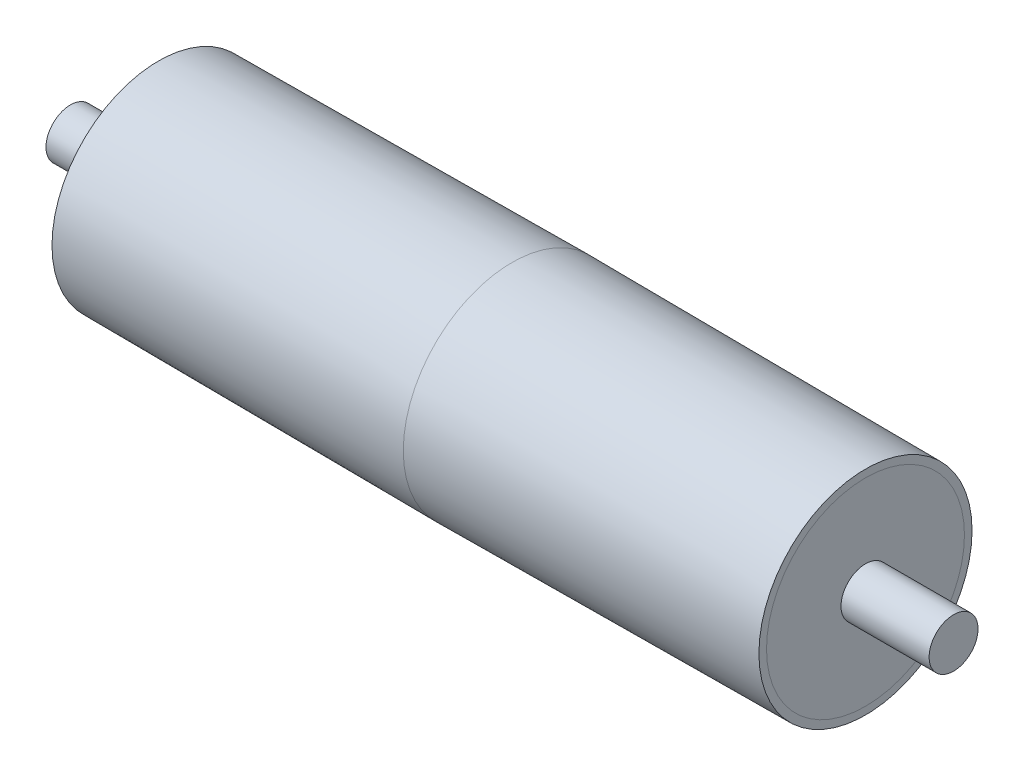
ISO-10303-21;
HEADER;
FILE_DESCRIPTION(('STEP AP214'),'2;1');
FILE_NAME('part.step','',(''),(''),'','','');
FILE_SCHEMA(('AUTOMOTIVE_DESIGN { 1 0 10303 214 1 1 1 1 }'));
ENDSEC;
DATA;
#1=APPLICATION_CONTEXT('core data for automotive mechanical design processes');
#2=APPLICATION_PROTOCOL_DEFINITION('international standard','automotive_design',2000,#1);
#3=PRODUCT_CONTEXT('',#1,'mechanical');
#4=PRODUCT('Part','Part','',(#3));
#5=PRODUCT_RELATED_PRODUCT_CATEGORY('part','',(#4));
#6=PRODUCT_DEFINITION_FORMATION('','',#4);
#7=PRODUCT_DEFINITION_CONTEXT('part definition',#1,'design');
#8=PRODUCT_DEFINITION('design','',#6,#7);
#9=PRODUCT_DEFINITION_SHAPE('','',#8);
#10=(LENGTH_UNIT() NAMED_UNIT(*) SI_UNIT(.MILLI.,.METRE.));
#11=(NAMED_UNIT(*) PLANE_ANGLE_UNIT() SI_UNIT($,.RADIAN.));
#12=(NAMED_UNIT(*) SI_UNIT($,.STERADIAN.) SOLID_ANGLE_UNIT());
#13=UNCERTAINTY_MEASURE_WITH_UNIT(LENGTH_MEASURE(1.E-05),#10,'distance_accuracy_value','');
#14=(GEOMETRIC_REPRESENTATION_CONTEXT(3) GLOBAL_UNCERTAINTY_ASSIGNED_CONTEXT((#13)) GLOBAL_UNIT_ASSIGNED_CONTEXT((#10,
#11,#12)) REPRESENTATION_CONTEXT('',''));
#15=CARTESIAN_POINT('',(0.,0.,0.));
#16=DIRECTION('',(0.,0.,1.));
#17=DIRECTION('',(1.,0.,0.));
#18=AXIS2_PLACEMENT_3D('',#15,#16,#17);
#19=CARTESIAN_POINT('',(406.,0.,0.));
#20=DIRECTION('',(-1.,0.,0.));
#21=DIRECTION('',(0.,0.,1.));
#22=AXIS2_PLACEMENT_3D('',#19,#20,#21);
#23=CYLINDRICAL_SURFACE('',#22,22.5);
#24=CARTESIAN_POINT('',(406.,0.,0.));
#25=DIRECTION('',(1.,0.,0.));
#26=DIRECTION('',(0.,0.,-1.));
#27=AXIS2_PLACEMENT_3D('',#24,#25,#26);
#28=CIRCLE('',#27,22.5);
#29=CARTESIAN_POINT('',(406.,0.,22.5));
#30=VERTEX_POINT('',#29);
#31=EDGE_CURVE('E11',#30,#30,#28,.T.);
#32=CARTESIAN_POINT('',(-406.,0.,0.));
#33=DIRECTION('',(1.,0.,0.));
#34=DIRECTION('',(0.,0.,-1.));
#35=AXIS2_PLACEMENT_3D('',#32,#33,#34);
#36=CIRCLE('',#35,22.5);
#37=CARTESIAN_POINT('',(-406.,0.,22.5));
#38=VERTEX_POINT('',#37);
#39=EDGE_CURVE('E45',#38,#38,#36,.T.);
#40=CARTESIAN_POINT('',(406.,0.,22.5));
#41=CARTESIAN_POINT('',(397.541666666667,0.,22.5));
#42=CARTESIAN_POINT('',(389.083333333333,0.,22.5));
#43=CARTESIAN_POINT('',(372.166666666667,0.,22.5));
#44=CARTESIAN_POINT('',(363.708333333333,0.,22.5));
#45=CARTESIAN_POINT('',(346.791666666667,0.,22.5));
#46=CARTESIAN_POINT('',(338.333333333333,0.,22.5));
#47=CARTESIAN_POINT('',(321.416666666667,0.,22.5));
#48=CARTESIAN_POINT('',(312.958333333333,0.,22.5));
#49=CARTESIAN_POINT('',(296.041666666667,0.,22.5));
#50=CARTESIAN_POINT('',(287.583333333333,0.,22.5));
#51=CARTESIAN_POINT('',(270.666666666667,0.,22.5));
#52=CARTESIAN_POINT('',(262.208333333333,0.,22.5));
#53=CARTESIAN_POINT('',(245.291666666667,0.,22.5));
#54=CARTESIAN_POINT('',(236.833333333333,0.,22.5));
#55=CARTESIAN_POINT('',(219.916666666667,0.,22.5));
#56=CARTESIAN_POINT('',(211.458333333333,0.,22.5));
#57=CARTESIAN_POINT('',(194.541666666667,0.,22.5));
#58=CARTESIAN_POINT('',(186.083333333333,0.,22.5));
#59=CARTESIAN_POINT('',(169.166666666667,0.,22.5));
#60=CARTESIAN_POINT('',(160.708333333333,0.,22.5));
#61=CARTESIAN_POINT('',(143.791666666667,0.,22.5));
#62=CARTESIAN_POINT('',(135.333333333333,0.,22.5));
#63=CARTESIAN_POINT('',(118.416666666667,0.,22.5));
#64=CARTESIAN_POINT('',(109.958333333333,0.,22.5));
#65=CARTESIAN_POINT('',(93.0416666666666,0.,22.5));
#66=CARTESIAN_POINT('',(84.5833333333333,0.,22.5));
#67=CARTESIAN_POINT('',(67.6666666666666,0.,22.5));
#68=CARTESIAN_POINT('',(59.2083333333333,0.,22.5));
#69=CARTESIAN_POINT('',(42.2916666666666,0.,22.5));
#70=CARTESIAN_POINT('',(33.8333333333333,0.,22.5));
#71=CARTESIAN_POINT('',(16.9166666666666,0.,22.5));
#72=CARTESIAN_POINT('',(8.45833333333329,0.,22.5));
#73=CARTESIAN_POINT('',(-8.4583333333334,0.,22.5));
#74=CARTESIAN_POINT('',(-16.9166666666667,0.,22.5));
#75=CARTESIAN_POINT('',(-33.8333333333334,0.,22.5));
#76=CARTESIAN_POINT('',(-42.2916666666667,0.,22.5));
#77=CARTESIAN_POINT('',(-59.2083333333334,0.,22.5));
#78=CARTESIAN_POINT('',(-67.6666666666667,0.,22.5));
#79=CARTESIAN_POINT('',(-84.5833333333334,0.,22.5));
#80=CARTESIAN_POINT('',(-93.0416666666667,0.,22.5));
#81=CARTESIAN_POINT('',(-109.958333333333,0.,22.5));
#82=CARTESIAN_POINT('',(-118.416666666667,0.,22.5));
#83=CARTESIAN_POINT('',(-135.333333333333,0.,22.5));
#84=CARTESIAN_POINT('',(-143.791666666667,0.,22.5));
#85=CARTESIAN_POINT('',(-160.708333333333,0.,22.5));
#86=CARTESIAN_POINT('',(-169.166666666667,0.,22.5));
#87=CARTESIAN_POINT('',(-186.083333333333,0.,22.5));
#88=CARTESIAN_POINT('',(-194.541666666667,0.,22.5));
#89=CARTESIAN_POINT('',(-211.458333333333,0.,22.5));
#90=CARTESIAN_POINT('',(-219.916666666667,0.,22.5));
#91=CARTESIAN_POINT('',(-236.833333333333,0.,22.5));
#92=CARTESIAN_POINT('',(-245.291666666667,0.,22.5));
#93=CARTESIAN_POINT('',(-262.208333333333,0.,22.5));
#94=CARTESIAN_POINT('',(-270.666666666667,0.,22.5));
#95=CARTESIAN_POINT('',(-287.583333333333,0.,22.5));
#96=CARTESIAN_POINT('',(-296.041666666667,0.,22.5));
#97=CARTESIAN_POINT('',(-312.958333333333,0.,22.5));
#98=CARTESIAN_POINT('',(-321.416666666667,0.,22.5));
#99=CARTESIAN_POINT('',(-338.333333333333,0.,22.5));
#100=CARTESIAN_POINT('',(-346.791666666667,0.,22.5));
#101=CARTESIAN_POINT('',(-363.708333333333,0.,22.5));
#102=CARTESIAN_POINT('',(-372.166666666667,0.,22.5));
#103=CARTESIAN_POINT('',(-389.083333333333,0.,22.5));
#104=CARTESIAN_POINT('',(-397.541666666667,0.,22.5));
#105=CARTESIAN_POINT('',(-406.,0.,22.5));
#106=B_SPLINE_CURVE_WITH_KNOTS('',3,(#40,#41,#42,#43,#44,#45,#46,#47,#48,#49,#50,#51,#52,#53,
#54,#55,#56,#57,#58,#59,#60,#61,#62,#63,#64,#65,#66,#67,#68,#69,#70,#71,#72,#73,#74,#75,#76,#77,
#78,#79,#80,#81,#82,#83,#84,#85,#86,#87,#88,#89,#90,#91,#92,#93,#94,#95,#96,#97,#98,#99,#100,
#101,#102,#103,#104,#105),.UNSPECIFIED.,.F.,.F.,(4,2,2,2,2,2,2,2,2,2,2,2,2,2,2,2,2,2,2,2,2,2,2,
2,2,2,2,2,2,2,2,2,4),(0.,25.375,50.75,76.1250000000001,101.5,126.875,152.25,177.625,203.,
228.375,253.75,279.125,304.5,329.875,355.25,380.625,406.,431.375,456.75,482.125,507.5,532.875,
558.25,583.625,609.,634.375,659.75,685.125,710.5,735.875,761.25,786.625,812.),.UNSPECIFIED.);
#107=EDGE_CURVE('BSEAM42',#30,#38,#106,.T.);
#108=ORIENTED_EDGE('',*,*,#31,.F.);
#109=ORIENTED_EDGE('',*,*,#39,.T.);
#110=ORIENTED_EDGE('',*,*,#107,.T.);
#111=ORIENTED_EDGE('',*,*,#107,.F.);
#112=EDGE_LOOP('',(#108,#110,#109,#111));
#113=FACE_BOUND('',#112,.T.);
#114=ADVANCED_FACE('F42',(#113),#23,.T.);
#115=CARTESIAN_POINT('',(406.,0.,0.));
#116=DIRECTION('',(1.,0.,0.));
#117=DIRECTION('',(0.,0.,-1.));
#118=AXIS2_PLACEMENT_3D('',#115,#116,#117);
#119=PLANE('',#118);
#120=ORIENTED_EDGE('',*,*,#31,.T.);
#121=EDGE_LOOP('',(#120));
#122=FACE_BOUND('',#121,.T.);
#123=ADVANCED_FACE('F57',(#122),#119,.T.);
#124=CARTESIAN_POINT('',(-406.,0.,0.));
#125=DIRECTION('',(1.,0.,0.));
#126=DIRECTION('',(0.,0.,-1.));
#127=AXIS2_PLACEMENT_3D('',#124,#125,#126);
#128=PLANE('',#127);
#129=ORIENTED_EDGE('',*,*,#39,.F.);
#130=EDGE_LOOP('',(#129));
#131=FACE_BOUND('',#130,.T.);
#132=ADVANCED_FACE('F55',(#131),#128,.F.);
#133=CLOSED_SHELL('',(#114,#123,#132));
#134=MANIFOLD_SOLID_BREP('B2',#133);
#135=CARTESIAN_POINT('',(-315.,0.,0.));
#136=DIRECTION('',(-1.,0.,0.));
#137=DIRECTION('',(0.,0.,-1.));
#138=AXIS2_PLACEMENT_3D('',#135,#136,#137);
#139=CYLINDRICAL_SURFACE('',#138,90.9998674568761);
#140=CARTESIAN_POINT('',(-315.,0.,0.));
#141=DIRECTION('',(1.,0.,0.));
#142=DIRECTION('',(0.,0.,-1.));
#143=AXIS2_PLACEMENT_3D('',#140,#141,#142);
#144=CIRCLE('',#143,90.9998674568761);
#145=CARTESIAN_POINT('',(-315.,0.,-90.9998674568761));
#146=VERTEX_POINT('',#145);
#147=EDGE_CURVE('E41',#146,#146,#144,.T.);
#148=ORIENTED_EDGE('',*,*,#147,.F.);
#149=EDGE_LOOP('',(#148));
#150=FACE_BOUND('',#149,.T.);
#151=CARTESIAN_POINT('',(-325.,0.,0.));
#152=DIRECTION('',(1.,0.,0.));
#153=DIRECTION('',(0.,0.,-1.));
#154=AXIS2_PLACEMENT_3D('',#151,#152,#153);
#155=CIRCLE('',#154,90.9998674568761);
#156=CARTESIAN_POINT('',(-325.,0.,-90.9998674568761));
#157=VERTEX_POINT('',#156);
#158=EDGE_CURVE('E98',#157,#157,#155,.T.);
#159=ORIENTED_EDGE('',*,*,#158,.T.);
#160=EDGE_LOOP('',(#159));
#161=FACE_BOUND('',#160,.T.);
#162=ADVANCED_FACE('F91',(#150,#161),#139,.T.);
#163=CARTESIAN_POINT('',(-315.,0.,0.));
#164=DIRECTION('',(-1.,0.,0.));
#165=DIRECTION('',(0.,0.,-1.));
#166=AXIS2_PLACEMENT_3D('',#163,#164,#165);
#167=PLANE('',#166);
#168=CARTESIAN_POINT('',(-315.,0.,0.));
#169=DIRECTION('',(-1.,0.,0.));
#170=DIRECTION('',(0.,0.,1.));
#171=AXIS2_PLACEMENT_3D('',#168,#169,#170);
#172=CIRCLE('',#171,22.5);
#173=CARTESIAN_POINT('',(-315.,0.,22.5));
#174=VERTEX_POINT('',#173);
#175=EDGE_CURVE('E103',#174,#174,#172,.T.);
#176=ORIENTED_EDGE('',*,*,#175,.T.);
#177=EDGE_LOOP('',(#176));
#178=FACE_BOUND('',#177,.T.);
#179=ORIENTED_EDGE('',*,*,#147,.T.);
#180=EDGE_LOOP('',(#179));
#181=FACE_BOUND('',#180,.T.);
#182=ADVANCED_FACE('F117',(#178,#181),#167,.F.);
#183=CARTESIAN_POINT('',(-325.,0.,0.));
#184=DIRECTION('',(-1.,0.,0.));
#185=DIRECTION('',(0.,0.,-1.));
#186=AXIS2_PLACEMENT_3D('',#183,#184,#185);
#187=PLANE('',#186);
#188=CARTESIAN_POINT('',(-325.,0.,0.));
#189=DIRECTION('',(-1.,0.,0.));
#190=DIRECTION('',(0.,0.,1.));
#191=AXIS2_PLACEMENT_3D('',#188,#189,#190);
#192=CIRCLE('',#191,22.5);
#193=CARTESIAN_POINT('',(-325.,0.,22.5));
#194=VERTEX_POINT('',#193);
#195=EDGE_CURVE('E94',#194,#194,#192,.T.);
#196=ORIENTED_EDGE('',*,*,#195,.F.);
#197=EDGE_LOOP('',(#196));
#198=FACE_BOUND('',#197,.T.);
#199=ORIENTED_EDGE('',*,*,#158,.F.);
#200=EDGE_LOOP('',(#199));
#201=FACE_BOUND('',#200,.T.);
#202=ADVANCED_FACE('F114',(#198,#201),#187,.T.);
#203=CARTESIAN_POINT('',(-410.,0.,0.));
#204=DIRECTION('',(1.,0.,0.));
#205=DIRECTION('',(0.,0.,-1.));
#206=AXIS2_PLACEMENT_3D('',#203,#204,#205);
#207=CYLINDRICAL_SURFACE('',#206,22.5);
#208=ORIENTED_EDGE('',*,*,#195,.T.);
#209=EDGE_LOOP('',(#208));
#210=FACE_BOUND('',#209,.T.);
#211=ORIENTED_EDGE('',*,*,#175,.F.);
#212=EDGE_LOOP('',(#211));
#213=FACE_BOUND('',#212,.T.);
#214=ADVANCED_FACE('F111',(#210,#213),#207,.F.);
#215=CLOSED_SHELL('',(#162,#182,#202,#214));
#216=MANIFOLD_SOLID_BREP('B6',#215);
#217=CARTESIAN_POINT('',(315.,0.,0.));
#218=DIRECTION('',(1.,0.,0.));
#219=DIRECTION('',(0.,0.,-1.));
#220=AXIS2_PLACEMENT_3D('',#217,#218,#219);
#221=CYLINDRICAL_SURFACE('',#220,90.9998674568761);
#222=CARTESIAN_POINT('',(315.,0.,0.));
#223=DIRECTION('',(1.,0.,0.));
#224=DIRECTION('',(0.,0.,-1.));
#225=AXIS2_PLACEMENT_3D('',#222,#223,#224);
#226=CIRCLE('',#225,90.9998674568761);
#227=CARTESIAN_POINT('',(315.,0.,-90.9998674568761));
#228=VERTEX_POINT('',#227);
#229=EDGE_CURVE('E90',#228,#228,#226,.T.);
#230=ORIENTED_EDGE('',*,*,#229,.T.);
#231=EDGE_LOOP('',(#230));
#232=FACE_BOUND('',#231,.T.);
#233=CARTESIAN_POINT('',(325.,0.,0.));
#234=DIRECTION('',(1.,0.,0.));
#235=DIRECTION('',(0.,0.,-1.));
#236=AXIS2_PLACEMENT_3D('',#233,#234,#235);
#237=CIRCLE('',#236,90.9998674568761);
#238=CARTESIAN_POINT('',(325.,0.,-90.9998674568761));
#239=VERTEX_POINT('',#238);
#240=EDGE_CURVE('E163',#239,#239,#237,.T.);
#241=ORIENTED_EDGE('',*,*,#240,.F.);
#242=EDGE_LOOP('',(#241));
#243=FACE_BOUND('',#242,.T.);
#244=ADVANCED_FACE('F160',(#232,#243),#221,.T.);
#245=CARTESIAN_POINT('',(315.,0.,0.));
#246=DIRECTION('',(1.,0.,0.));
#247=DIRECTION('',(0.,0.,-1.));
#248=AXIS2_PLACEMENT_3D('',#245,#246,#247);
#249=PLANE('',#248);
#250=CARTESIAN_POINT('',(315.,0.,0.));
#251=DIRECTION('',(1.,0.,0.));
#252=DIRECTION('',(0.,0.,-1.));
#253=AXIS2_PLACEMENT_3D('',#250,#251,#252);
#254=CIRCLE('',#253,22.5);
#255=CARTESIAN_POINT('',(315.,0.,-22.5));
#256=VERTEX_POINT('',#255);
#257=EDGE_CURVE('E170',#256,#256,#254,.T.);
#258=ORIENTED_EDGE('',*,*,#257,.T.);
#259=EDGE_LOOP('',(#258));
#260=FACE_BOUND('',#259,.T.);
#261=ORIENTED_EDGE('',*,*,#229,.F.);
#262=EDGE_LOOP('',(#261));
#263=FACE_BOUND('',#262,.T.);
#264=ADVANCED_FACE('F184',(#260,#263),#249,.F.);
#265=CARTESIAN_POINT('',(325.,0.,0.));
#266=DIRECTION('',(1.,0.,0.));
#267=DIRECTION('',(0.,0.,-1.));
#268=AXIS2_PLACEMENT_3D('',#265,#266,#267);
#269=PLANE('',#268);
#270=CARTESIAN_POINT('',(325.,0.,0.));
#271=DIRECTION('',(1.,0.,0.));
#272=DIRECTION('',(0.,0.,-1.));
#273=AXIS2_PLACEMENT_3D('',#270,#271,#272);
#274=CIRCLE('',#273,22.5);
#275=CARTESIAN_POINT('',(325.,0.,-22.5));
#276=VERTEX_POINT('',#275);
#277=EDGE_CURVE('E174',#276,#276,#274,.T.);
#278=ORIENTED_EDGE('',*,*,#277,.F.);
#279=EDGE_LOOP('',(#278));
#280=FACE_BOUND('',#279,.T.);
#281=ORIENTED_EDGE('',*,*,#240,.T.);
#282=EDGE_LOOP('',(#281));
#283=FACE_BOUND('',#282,.T.);
#284=ADVANCED_FACE('F181',(#280,#283),#269,.T.);
#285=CARTESIAN_POINT('',(-410.,0.,0.));
#286=DIRECTION('',(1.,0.,0.));
#287=DIRECTION('',(0.,0.,-1.));
#288=AXIS2_PLACEMENT_3D('',#285,#286,#287);
#289=CYLINDRICAL_SURFACE('',#288,22.5);
#290=ORIENTED_EDGE('',*,*,#277,.T.);
#291=EDGE_LOOP('',(#290));
#292=FACE_BOUND('',#291,.T.);
#293=ORIENTED_EDGE('',*,*,#257,.F.);
#294=EDGE_LOOP('',(#293));
#295=FACE_BOUND('',#294,.T.);
#296=ADVANCED_FACE('F178',(#292,#295),#289,.F.);
#297=CLOSED_SHELL('',(#244,#264,#284,#296));
#298=MANIFOLD_SOLID_BREP('B36',#297);
#299=CARTESIAN_POINT('',(-325.,98.,0.));
#300=DIRECTION('',(1.,0.,0.));
#301=DIRECTION('',(0.,0.,-1.));
#302=AXIS2_PLACEMENT_3D('',#299,#300,#301);
#303=PLANE('',#302);
#304=CARTESIAN_POINT('',(-325.,0.,0.));
#305=DIRECTION('',(1.,0.,0.));
#306=DIRECTION('',(0.,0.,-1.));
#307=AXIS2_PLACEMENT_3D('',#304,#305,#306);
#308=CIRCLE('',#307,90.9998674568761);
#309=CARTESIAN_POINT('',(-325.,0.,-90.9998674568761));
#310=VERTEX_POINT('',#309);
#311=EDGE_CURVE('E239',#310,#310,#308,.F.);
#312=ORIENTED_EDGE('',*,*,#311,.F.);
#313=EDGE_LOOP('',(#312));
#314=FACE_BOUND('',#313,.T.);
#315=CARTESIAN_POINT('',(-325.,0.,0.));
#316=DIRECTION('',(-1.,0.,0.));
#317=DIRECTION('',(0.,0.,1.));
#318=AXIS2_PLACEMENT_3D('',#315,#316,#317);
#319=CIRCLE('',#318,98.);
#320=CARTESIAN_POINT('',(-325.,0.,98.));
#321=VERTEX_POINT('',#320);
#322=EDGE_CURVE('E232',#321,#321,#319,.T.);
#323=ORIENTED_EDGE('',*,*,#322,.T.);
#324=EDGE_LOOP('',(#323));
#325=FACE_BOUND('',#324,.T.);
#326=ADVANCED_FACE('F222',(#314,#325),#303,.F.);
#327=CARTESIAN_POINT('',(325.,0.,0.));
#328=DIRECTION('',(-1.,0.,0.));
#329=DIRECTION('',(0.,0.,1.));
#330=AXIS2_PLACEMENT_3D('',#327,#328,#329);
#331=PLANE('',#330);
#332=CARTESIAN_POINT('',(325.,0.,0.));
#333=DIRECTION('',(-1.,0.,0.));
#334=DIRECTION('',(0.,0.,1.));
#335=AXIS2_PLACEMENT_3D('',#332,#333,#334);
#336=CIRCLE('',#335,90.9998674568761);
#337=CARTESIAN_POINT('',(325.,0.,90.9998674568761));
#338=VERTEX_POINT('',#337);
#339=EDGE_CURVE('E236',#338,#338,#336,.T.);
#340=ORIENTED_EDGE('',*,*,#339,.T.);
#341=EDGE_LOOP('',(#340));
#342=FACE_BOUND('',#341,.T.);
#343=CARTESIAN_POINT('',(325.,0.,0.));
#344=DIRECTION('',(-1.,0.,0.));
#345=DIRECTION('',(0.,0.,1.));
#346=AXIS2_PLACEMENT_3D('',#343,#344,#345);
#347=CIRCLE('',#346,98.);
#348=CARTESIAN_POINT('',(325.,0.,98.));
#349=VERTEX_POINT('',#348);
#350=EDGE_CURVE('E159',#349,#349,#347,.T.);
#351=ORIENTED_EDGE('',*,*,#350,.F.);
#352=EDGE_LOOP('',(#351));
#353=FACE_BOUND('',#352,.T.);
#354=ADVANCED_FACE('F262',(#342,#353),#331,.F.);
#355=CARTESIAN_POINT('',(325.,0.,0.));
#356=DIRECTION('',(-1.,0.,0.));
#357=DIRECTION('',(0.,0.,1.));
#358=AXIS2_PLACEMENT_3D('',#355,#356,#357);
#359=CONICAL_SURFACE('',#358,98.,0.00615376847392404);
#360=CARTESIAN_POINT('',(0.,0.,0.));
#361=DIRECTION('',(-1.,0.,0.));
#362=DIRECTION('',(0.,0.,1.));
#363=AXIS2_PLACEMENT_3D('',#360,#361,#362);
#364=CIRCLE('',#363,100.);
#365=CARTESIAN_POINT('',(0.,0.,100.));
#366=VERTEX_POINT('',#365);
#367=EDGE_CURVE('E228',#366,#366,#364,.T.);
#368=ORIENTED_EDGE('',*,*,#367,.F.);
#369=EDGE_LOOP('',(#368));
#370=FACE_BOUND('',#369,.T.);
#371=ORIENTED_EDGE('',*,*,#350,.T.);
#372=EDGE_LOOP('',(#371));
#373=FACE_BOUND('',#372,.T.);
#374=ADVANCED_FACE('F267',(#370,#373),#359,.T.);
#375=CARTESIAN_POINT('',(0.,0.,0.));
#376=DIRECTION('',(1.,0.,0.));
#377=DIRECTION('',(0.,0.,-1.));
#378=AXIS2_PLACEMENT_3D('',#375,#376,#377);
#379=CONICAL_SURFACE('',#378,100.,0.00615376847392404);
#380=ORIENTED_EDGE('',*,*,#322,.F.);
#381=EDGE_LOOP('',(#380));
#382=FACE_BOUND('',#381,.T.);
#383=ORIENTED_EDGE('',*,*,#367,.T.);
#384=EDGE_LOOP('',(#383));
#385=FACE_BOUND('',#384,.T.);
#386=ADVANCED_FACE('F258',(#382,#385),#379,.T.);
#387=CARTESIAN_POINT('',(324.956923892558,0.,0.));
#388=DIRECTION('',(-1.,0.,0.));
#389=DIRECTION('',(0.,0.,1.));
#390=AXIS2_PLACEMENT_3D('',#387,#388,#389);
#391=CONICAL_SURFACE('',#390,91.0001325406142,0.00615376847392404);
#392=CARTESIAN_POINT('',(-3.5527136788005E-12,0.,0.));
#393=DIRECTION('',(-1.,0.,0.));
#394=DIRECTION('',(0.,0.,1.));
#395=AXIS2_PLACEMENT_3D('',#392,#393,#394);
#396=CIRCLE('',#395,92.9998674568761);
#397=CARTESIAN_POINT('',(-3.5527136788005E-12,0.,92.9998674568761));
#398=VERTEX_POINT('',#397);
#399=EDGE_CURVE('E242',#398,#398,#396,.T.);
#400=ORIENTED_EDGE('',*,*,#399,.T.);
#401=EDGE_LOOP('',(#400));
#402=FACE_BOUND('',#401,.T.);
#403=ORIENTED_EDGE('',*,*,#339,.F.);
#404=EDGE_LOOP('',(#403));
#405=FACE_BOUND('',#404,.T.);
#406=ADVANCED_FACE('F248',(#402,#405),#391,.F.);
#407=CARTESIAN_POINT('',(0.0430761074423739,0.,0.));
#408=DIRECTION('',(1.,0.,0.));
#409=DIRECTION('',(0.,0.,-1.));
#410=AXIS2_PLACEMENT_3D('',#407,#408,#409);
#411=CONICAL_SURFACE('',#410,93.0001325406142,0.00615376847392404);
#412=ORIENTED_EDGE('',*,*,#311,.T.);
#413=EDGE_LOOP('',(#412));
#414=FACE_BOUND('',#413,.T.);
#415=ORIENTED_EDGE('',*,*,#399,.F.);
#416=EDGE_LOOP('',(#415));
#417=FACE_BOUND('',#416,.T.);
#418=ADVANCED_FACE('F251',(#414,#417),#411,.F.);
#419=CLOSED_SHELL('',(#326,#354,#374,#386,#406,#418));
#420=MANIFOLD_SOLID_BREP('B85',#419);
#421=ADVANCED_BREP_SHAPE_REPRESENTATION('',(#18,#134,#216,#298,#420),#14);
#422=SHAPE_DEFINITION_REPRESENTATION(#9,#421);
ENDSEC;
END-ISO-10303-21;
